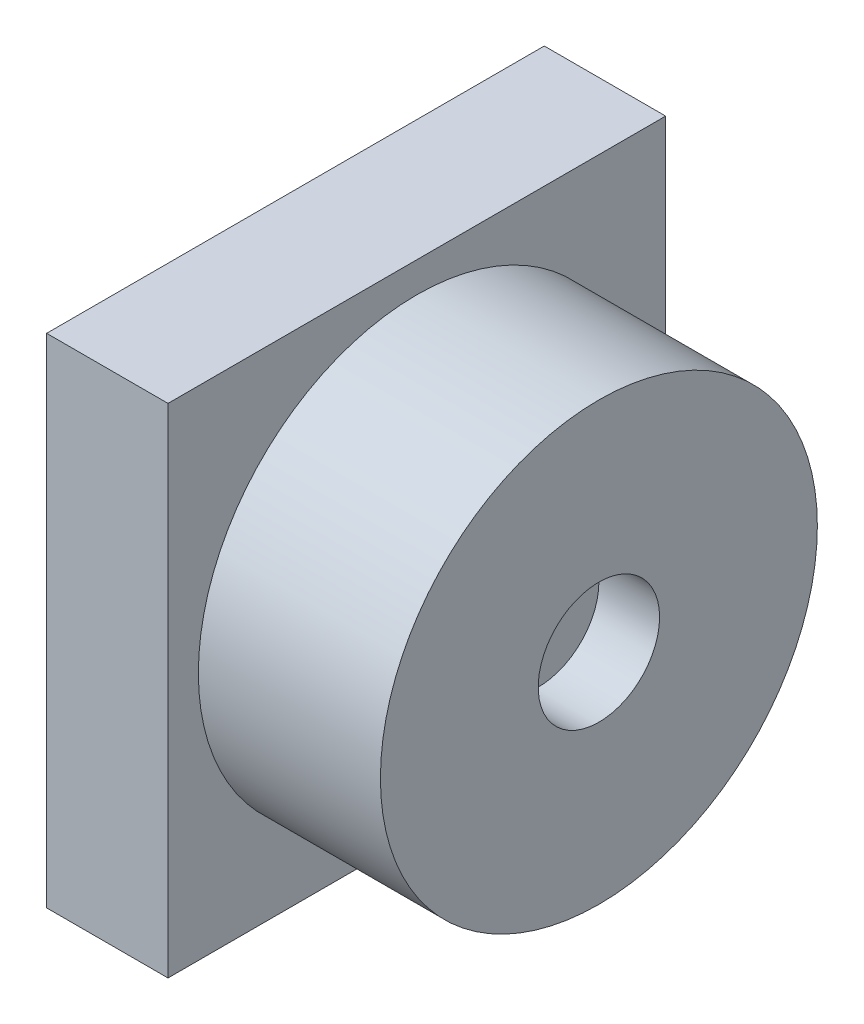
ISO-10303-21;
HEADER;
FILE_DESCRIPTION(('STEP AP214'),'2;1');
FILE_NAME('part.step','',(''),(''),'','','');
FILE_SCHEMA(('AUTOMOTIVE_DESIGN { 1 0 10303 214 1 1 1 1 }'));
ENDSEC;
DATA;
#1=APPLICATION_CONTEXT('core data for automotive mechanical design processes');
#2=APPLICATION_PROTOCOL_DEFINITION('international standard','automotive_design',2000,#1);
#3=PRODUCT_CONTEXT('',#1,'mechanical');
#4=PRODUCT('Part','Part','',(#3));
#5=PRODUCT_RELATED_PRODUCT_CATEGORY('part','',(#4));
#6=PRODUCT_DEFINITION_FORMATION('','',#4);
#7=PRODUCT_DEFINITION_CONTEXT('part definition',#1,'design');
#8=PRODUCT_DEFINITION('design','',#6,#7);
#9=PRODUCT_DEFINITION_SHAPE('','',#8);
#10=(LENGTH_UNIT() NAMED_UNIT(*) SI_UNIT(.MILLI.,.METRE.));
#11=(NAMED_UNIT(*) PLANE_ANGLE_UNIT() SI_UNIT($,.RADIAN.));
#12=(NAMED_UNIT(*) SI_UNIT($,.STERADIAN.) SOLID_ANGLE_UNIT());
#13=UNCERTAINTY_MEASURE_WITH_UNIT(LENGTH_MEASURE(1.E-05),#10,'distance_accuracy_value','');
#14=(GEOMETRIC_REPRESENTATION_CONTEXT(3) GLOBAL_UNCERTAINTY_ASSIGNED_CONTEXT((#13)) GLOBAL_UNIT_ASSIGNED_CONTEXT((#10,
#11,#12)) REPRESENTATION_CONTEXT('',''));
#15=CARTESIAN_POINT('',(0.,0.,0.));
#16=DIRECTION('',(0.,0.,1.));
#17=DIRECTION('',(1.,0.,0.));
#18=AXIS2_PLACEMENT_3D('',#15,#16,#17);
#19=CARTESIAN_POINT('',(-2.50000000000007,51.6000355258275,0.214197614682958));
#20=DIRECTION('',(-1.,0.,0.));
#21=DIRECTION('',(0.,0.,1.));
#22=AXIS2_PLACEMENT_3D('',#19,#20,#21);
#23=CYLINDRICAL_SURFACE('',#22,3.6);
#24=CARTESIAN_POINT('',(-2.50000000000007,51.6000355258275,0.214197614682958));
#25=DIRECTION('',(1.,0.,0.));
#26=DIRECTION('',(0.,0.,-1.));
#27=AXIS2_PLACEMENT_3D('',#24,#25,#26);
#28=CIRCLE('',#27,3.6);
#29=CARTESIAN_POINT('',(-2.50000000000007,51.6000355258275,-3.38580238531704));
#30=VERTEX_POINT('',#29);
#31=EDGE_CURVE('E12',#30,#30,#28,.T.);
#32=ORIENTED_EDGE('',*,*,#31,.F.);
#33=EDGE_LOOP('',(#32));
#34=FACE_BOUND('',#33,.T.);
#35=CARTESIAN_POINT('',(-5.50000000000007,51.6000355258275,0.214197614682958));
#36=DIRECTION('',(1.,0.,0.));
#37=DIRECTION('',(0.,0.,-1.));
#38=AXIS2_PLACEMENT_3D('',#35,#36,#37);
#39=CIRCLE('',#38,3.6);
#40=CARTESIAN_POINT('',(-5.50000000000007,51.6000355258275,-3.38580238531704));
#41=VERTEX_POINT('',#40);
#42=EDGE_CURVE('E91',#41,#41,#39,.T.);
#43=ORIENTED_EDGE('',*,*,#42,.T.);
#44=EDGE_LOOP('',(#43));
#45=FACE_BOUND('',#44,.T.);
#46=ADVANCED_FACE('F88',(#34,#45),#23,.T.);
#47=CARTESIAN_POINT('',(-2.50000000000007,51.6000355258275,0.214197614682958));
#48=DIRECTION('',(1.,0.,0.));
#49=DIRECTION('',(0.,0.,-1.));
#50=AXIS2_PLACEMENT_3D('',#47,#48,#49);
#51=PLANE('',#50);
#52=CARTESIAN_POINT('',(-2.50000000000007,51.6000355258275,0.214197614682958));
#53=DIRECTION('',(1.,0.,0.));
#54=DIRECTION('',(0.,0.,-1.));
#55=AXIS2_PLACEMENT_3D('',#52,#53,#54);
#56=CIRCLE('',#55,1.);
#57=CARTESIAN_POINT('',(-2.50000000000007,51.6000355258275,-0.785802385317042));
#58=VERTEX_POINT('',#57);
#59=EDGE_CURVE('E100',#58,#58,#56,.T.);
#60=ORIENTED_EDGE('',*,*,#59,.F.);
#61=EDGE_LOOP('',(#60));
#62=FACE_BOUND('',#61,.T.);
#63=ORIENTED_EDGE('',*,*,#31,.T.);
#64=EDGE_LOOP('',(#63));
#65=FACE_BOUND('',#64,.T.);
#66=ADVANCED_FACE('F115',(#62,#65),#51,.T.);
#67=CARTESIAN_POINT('',(-5.50000000000007,51.6000355258275,0.214197614682958));
#68=DIRECTION('',(1.,0.,0.));
#69=DIRECTION('',(0.,0.,-1.));
#70=AXIS2_PLACEMENT_3D('',#67,#68,#69);
#71=PLANE('',#70);
#72=ORIENTED_EDGE('',*,*,#42,.F.);
#73=EDGE_LOOP('',(#72));
#74=FACE_BOUND('',#73,.T.);
#75=ADVANCED_FACE('F111',(#74),#71,.F.);
#76=CARTESIAN_POINT('',(-3.50000000000007,51.6000355258275,0.214197614682958));
#77=DIRECTION('',(1.,0.,0.));
#78=DIRECTION('',(0.,0.,-1.));
#79=AXIS2_PLACEMENT_3D('',#76,#77,#78);
#80=CYLINDRICAL_SURFACE('',#79,1.);
#81=CARTESIAN_POINT('',(-3.50000000000007,51.6000355258275,0.214197614682958));
#82=DIRECTION('',(1.,0.,0.));
#83=DIRECTION('',(0.,0.,-1.));
#84=AXIS2_PLACEMENT_3D('',#81,#82,#83);
#85=CIRCLE('',#84,1.);
#86=CARTESIAN_POINT('',(-3.50000000000007,51.6000355258275,-0.785802385317042));
#87=VERTEX_POINT('',#86);
#88=EDGE_CURVE('E98',#87,#87,#85,.T.);
#89=ORIENTED_EDGE('',*,*,#88,.F.);
#90=EDGE_LOOP('',(#89));
#91=FACE_BOUND('',#90,.T.);
#92=ORIENTED_EDGE('',*,*,#59,.T.);
#93=EDGE_LOOP('',(#92));
#94=FACE_BOUND('',#93,.T.);
#95=ADVANCED_FACE('F108',(#91,#94),#80,.F.);
#96=CARTESIAN_POINT('',(-3.50000000000007,51.6000355258275,0.214197614682958));
#97=DIRECTION('',(1.,0.,0.));
#98=DIRECTION('',(0.,0.,-1.));
#99=AXIS2_PLACEMENT_3D('',#96,#97,#98);
#100=PLANE('',#99);
#101=ORIENTED_EDGE('',*,*,#88,.T.);
#102=EDGE_LOOP('',(#101));
#103=FACE_BOUND('',#102,.T.);
#104=ADVANCED_FACE('F106',(#103),#100,.T.);
#105=CLOSED_SHELL('',(#46,#66,#75,#95,#104));
#106=MANIFOLD_SOLID_BREP('B2',#105);
#107=CARTESIAN_POINT('',(-7.50000000000007,55.7000355258275,-3.88580238531704));
#108=DIRECTION('',(0.,0.,1.));
#109=DIRECTION('',(1.,0.,0.));
#110=AXIS2_PLACEMENT_3D('',#107,#108,#109);
#111=PLANE('',#110);
#112=DIRECTION('',(0.,-1.,0.));
#113=VECTOR('',#112,1.);
#114=CARTESIAN_POINT('',(-5.50000000000007,55.7000355258275,-3.88580238531704));
#115=LINE('',#114,#113);
#116=CARTESIAN_POINT('',(-5.50000000000007,55.7000355258275,-3.88580238531704));
#117=VERTEX_POINT('',#116);
#118=CARTESIAN_POINT('',(-5.50000000000007,47.5000355258275,-3.88580238531704));
#119=VERTEX_POINT('',#118);
#120=EDGE_CURVE('E246',#117,#119,#115,.T.);
#121=ORIENTED_EDGE('',*,*,#120,.T.);
#122=DIRECTION('',(1.,0.,0.));
#123=VECTOR('',#122,1.);
#124=CARTESIAN_POINT('',(-7.50000000000007,47.5000355258275,-3.88580238531704));
#125=LINE('',#124,#123);
#126=CARTESIAN_POINT('',(-7.50000000000007,47.5000355258275,-3.88580238531704));
#127=VERTEX_POINT('',#126);
#128=EDGE_CURVE('E86',#127,#119,#125,.T.);
#129=ORIENTED_EDGE('',*,*,#128,.F.);
#130=DIRECTION('',(0.,-1.,0.));
#131=VECTOR('',#130,1.);
#132=CARTESIAN_POINT('',(-7.50000000000007,55.7000355258275,-3.88580238531704));
#133=LINE('',#132,#131);
#134=CARTESIAN_POINT('',(-7.50000000000007,55.7000355258275,-3.88580238531704));
#135=VERTEX_POINT('',#134);
#136=EDGE_CURVE('E234',#135,#127,#133,.T.);
#137=ORIENTED_EDGE('',*,*,#136,.F.);
#138=DIRECTION('',(1.,0.,0.));
#139=VECTOR('',#138,1.);
#140=CARTESIAN_POINT('',(-7.50000000000007,55.7000355258275,-3.88580238531704));
#141=LINE('',#140,#139);
#142=EDGE_CURVE('E242',#135,#117,#141,.T.);
#143=ORIENTED_EDGE('',*,*,#142,.T.);
#144=EDGE_LOOP('',(#121,#129,#137,#143));
#145=FACE_BOUND('',#144,.T.);
#146=ADVANCED_FACE('F183',(#145),#111,.F.);
#147=CARTESIAN_POINT('',(-7.50000000000007,47.5000355258275,-3.88580238531704));
#148=DIRECTION('',(0.,1.,0.));
#149=DIRECTION('',(0.,0.,1.));
#150=AXIS2_PLACEMENT_3D('',#147,#148,#149);
#151=PLANE('',#150);
#152=DIRECTION('',(0.,0.,1.));
#153=VECTOR('',#152,1.);
#154=CARTESIAN_POINT('',(-5.50000000000007,47.5000355258275,-3.88580238531704));
#155=LINE('',#154,#153);
#156=CARTESIAN_POINT('',(-5.50000000000007,47.5000355258275,4.31419761468296));
#157=VERTEX_POINT('',#156);
#158=EDGE_CURVE('E238',#119,#157,#155,.T.);
#159=ORIENTED_EDGE('',*,*,#158,.T.);
#160=DIRECTION('',(1.,0.,0.));
#161=VECTOR('',#160,1.);
#162=CARTESIAN_POINT('',(-7.50000000000007,47.5000355258275,4.31419761468296));
#163=LINE('',#162,#161);
#164=CARTESIAN_POINT('',(-7.50000000000007,47.5000355258275,4.31419761468296));
#165=VERTEX_POINT('',#164);
#166=EDGE_CURVE('E191',#165,#157,#163,.T.);
#167=ORIENTED_EDGE('',*,*,#166,.F.);
#168=DIRECTION('',(0.,0.,1.));
#169=VECTOR('',#168,1.);
#170=CARTESIAN_POINT('',(-7.50000000000007,47.5000355258275,-3.88580238531704));
#171=LINE('',#170,#169);
#172=EDGE_CURVE('E229',#127,#165,#171,.T.);
#173=ORIENTED_EDGE('',*,*,#172,.F.);
#174=ORIENTED_EDGE('',*,*,#128,.T.);
#175=EDGE_LOOP('',(#159,#167,#173,#174));
#176=FACE_BOUND('',#175,.T.);
#177=ADVANCED_FACE('F237',(#176),#151,.F.);
#178=CARTESIAN_POINT('',(-7.50000000000007,55.7000355258275,4.31419761468296));
#179=DIRECTION('',(0.,0.,-1.));
#180=DIRECTION('',(-1.,0.,0.));
#181=AXIS2_PLACEMENT_3D('',#178,#179,#180);
#182=PLANE('',#181);
#183=DIRECTION('',(0.,1.,0.));
#184=VECTOR('',#183,1.);
#185=CARTESIAN_POINT('',(-5.50000000000007,55.7000355258275,4.31419761468296));
#186=LINE('',#185,#184);
#187=CARTESIAN_POINT('',(-5.50000000000007,55.7000355258275,4.31419761468296));
#188=VERTEX_POINT('',#187);
#189=EDGE_CURVE('E216',#157,#188,#186,.T.);
#190=ORIENTED_EDGE('',*,*,#189,.T.);
#191=DIRECTION('',(1.,0.,0.));
#192=VECTOR('',#191,1.);
#193=CARTESIAN_POINT('',(-7.50000000000007,55.7000355258275,4.31419761468296));
#194=LINE('',#193,#192);
#195=CARTESIAN_POINT('',(-7.50000000000007,55.7000355258275,4.31419761468296));
#196=VERTEX_POINT('',#195);
#197=EDGE_CURVE('E239',#196,#188,#194,.T.);
#198=ORIENTED_EDGE('',*,*,#197,.F.);
#199=DIRECTION('',(0.,1.,0.));
#200=VECTOR('',#199,1.);
#201=CARTESIAN_POINT('',(-7.50000000000007,55.7000355258275,4.31419761468296));
#202=LINE('',#201,#200);
#203=EDGE_CURVE('E232',#165,#196,#202,.T.);
#204=ORIENTED_EDGE('',*,*,#203,.F.);
#205=ORIENTED_EDGE('',*,*,#166,.T.);
#206=EDGE_LOOP('',(#190,#198,#204,#205));
#207=FACE_BOUND('',#206,.T.);
#208=ADVANCED_FACE('F240',(#207),#182,.F.);
#209=CARTESIAN_POINT('',(-7.50000000000007,55.7000355258275,-3.88580238531704));
#210=DIRECTION('',(0.,-1.,0.));
#211=DIRECTION('',(0.,0.,-1.));
#212=AXIS2_PLACEMENT_3D('',#209,#210,#211);
#213=PLANE('',#212);
#214=DIRECTION('',(0.,0.,-1.));
#215=VECTOR('',#214,1.);
#216=CARTESIAN_POINT('',(-5.50000000000007,55.7000355258275,-3.88580238531704));
#217=LINE('',#216,#215);
#218=EDGE_CURVE('E222',#188,#117,#217,.T.);
#219=ORIENTED_EDGE('',*,*,#218,.T.);
#220=ORIENTED_EDGE('',*,*,#142,.F.);
#221=DIRECTION('',(0.,0.,-1.));
#222=VECTOR('',#221,1.);
#223=CARTESIAN_POINT('',(-7.50000000000007,55.7000355258275,-3.88580238531704));
#224=LINE('',#223,#222);
#225=EDGE_CURVE('E199',#196,#135,#224,.T.);
#226=ORIENTED_EDGE('',*,*,#225,.F.);
#227=ORIENTED_EDGE('',*,*,#197,.T.);
#228=EDGE_LOOP('',(#219,#220,#226,#227));
#229=FACE_BOUND('',#228,.T.);
#230=ADVANCED_FACE('F253',(#229),#213,.F.);
#231=CARTESIAN_POINT('',(-7.50000000000007,0.,0.));
#232=DIRECTION('',(-1.,0.,0.));
#233=DIRECTION('',(0.,0.,1.));
#234=AXIS2_PLACEMENT_3D('',#231,#232,#233);
#235=PLANE('',#234);
#236=ORIENTED_EDGE('',*,*,#136,.T.);
#237=ORIENTED_EDGE('',*,*,#172,.T.);
#238=ORIENTED_EDGE('',*,*,#203,.T.);
#239=ORIENTED_EDGE('',*,*,#225,.T.);
#240=EDGE_LOOP('',(#236,#237,#238,#239));
#241=FACE_BOUND('',#240,.T.);
#242=ADVANCED_FACE('F230',(#241),#235,.T.);
#243=CARTESIAN_POINT('',(-5.50000000000007,0.,0.));
#244=DIRECTION('',(-1.,0.,0.));
#245=DIRECTION('',(0.,0.,1.));
#246=AXIS2_PLACEMENT_3D('',#243,#244,#245);
#247=PLANE('',#246);
#248=ORIENTED_EDGE('',*,*,#120,.F.);
#249=ORIENTED_EDGE('',*,*,#218,.F.);
#250=ORIENTED_EDGE('',*,*,#189,.F.);
#251=ORIENTED_EDGE('',*,*,#158,.F.);
#252=EDGE_LOOP('',(#248,#249,#250,#251));
#253=FACE_BOUND('',#252,.T.);
#254=ADVANCED_FACE('F256',(#253),#247,.F.);
#255=CLOSED_SHELL('',(#146,#177,#208,#230,#242,#254));
#256=MANIFOLD_SOLID_BREP('B7',#255);
#257=ADVANCED_BREP_SHAPE_REPRESENTATION('',(#18,#106,#256),#14);
#258=SHAPE_DEFINITION_REPRESENTATION(#9,#257);
ENDSEC;
END-ISO-10303-21;
